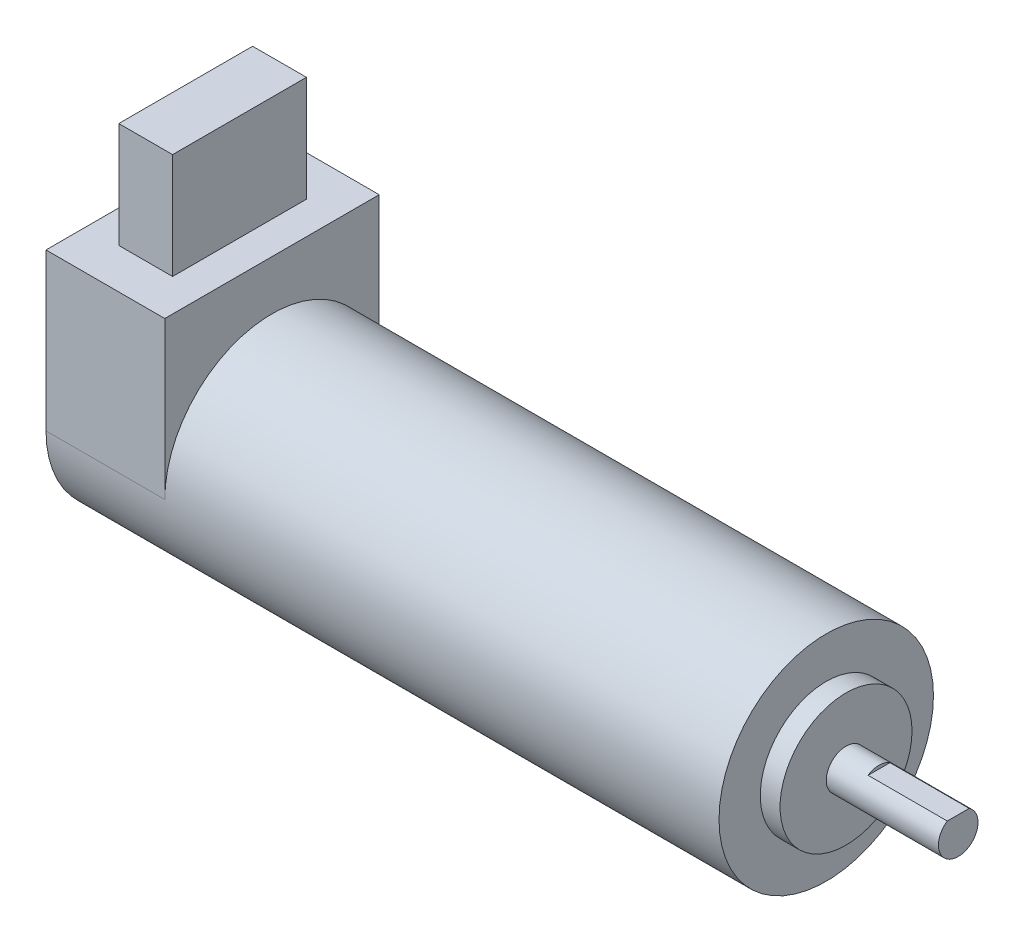
ISO-10303-21;
HEADER;
FILE_DESCRIPTION(('STEP AP214'),'2;1');
FILE_NAME('part.step','',(''),(''),'','','');
FILE_SCHEMA(('AUTOMOTIVE_DESIGN { 1 0 10303 214 1 1 1 1 }'));
ENDSEC;
DATA;
#1=APPLICATION_CONTEXT('core data for automotive mechanical design processes');
#2=APPLICATION_PROTOCOL_DEFINITION('international standard','automotive_design',2000,#1);
#3=PRODUCT_CONTEXT('',#1,'mechanical');
#4=PRODUCT('Part','Part','',(#3));
#5=PRODUCT_RELATED_PRODUCT_CATEGORY('part','',(#4));
#6=PRODUCT_DEFINITION_FORMATION('','',#4);
#7=PRODUCT_DEFINITION_CONTEXT('part definition',#1,'design');
#8=PRODUCT_DEFINITION('design','',#6,#7);
#9=PRODUCT_DEFINITION_SHAPE('','',#8);
#10=(LENGTH_UNIT() NAMED_UNIT(*) SI_UNIT(.MILLI.,.METRE.));
#11=(NAMED_UNIT(*) PLANE_ANGLE_UNIT() SI_UNIT($,.RADIAN.));
#12=(NAMED_UNIT(*) SI_UNIT($,.STERADIAN.) SOLID_ANGLE_UNIT());
#13=UNCERTAINTY_MEASURE_WITH_UNIT(LENGTH_MEASURE(1.E-05),#10,'distance_accuracy_value','');
#14=(GEOMETRIC_REPRESENTATION_CONTEXT(3) GLOBAL_UNCERTAINTY_ASSIGNED_CONTEXT((#13)) GLOBAL_UNIT_ASSIGNED_CONTEXT((#10,
#11,#12)) REPRESENTATION_CONTEXT('',''));
#15=CARTESIAN_POINT('',(0.,0.,0.));
#16=DIRECTION('',(0.,0.,1.));
#17=DIRECTION('',(1.,0.,0.));
#18=AXIS2_PLACEMENT_3D('',#15,#16,#17);
#19=CARTESIAN_POINT('',(84.,0.,0.));
#20=DIRECTION('',(-1.,0.,0.));
#21=DIRECTION('',(0.,0.,1.));
#22=AXIS2_PLACEMENT_3D('',#19,#20,#21);
#23=CYLINDRICAL_SURFACE('',#22,16.25);
#24=CARTESIAN_POINT('',(84.,0.,0.));
#25=DIRECTION('',(1.,0.,0.));
#26=DIRECTION('',(0.,0.,-1.));
#27=AXIS2_PLACEMENT_3D('',#24,#25,#26);
#28=CIRCLE('',#27,16.25);
#29=CARTESIAN_POINT('',(84.,0.,-16.25));
#30=VERTEX_POINT('',#29);
#31=EDGE_CURVE('E186',#30,#30,#28,.T.);
#32=ORIENTED_EDGE('',*,*,#31,.F.);
#33=EDGE_LOOP('',(#32));
#34=FACE_BOUND('',#33,.T.);
#35=CARTESIAN_POINT('',(0.,0.,0.));
#36=DIRECTION('',(1.,0.,0.));
#37=DIRECTION('',(0.,0.,-1.));
#38=AXIS2_PLACEMENT_3D('',#35,#36,#37);
#39=CIRCLE('',#38,16.25);
#40=CARTESIAN_POINT('',(0.,0.,-16.25));
#41=VERTEX_POINT('',#40);
#42=CARTESIAN_POINT('',(0.,0.,16.25));
#43=VERTEX_POINT('',#42);
#44=EDGE_CURVE('E38',#41,#43,#39,.T.);
#45=ORIENTED_EDGE('',*,*,#44,.T.);
#46=DIRECTION('',(1.,0.,0.));
#47=VECTOR('',#46,1.);
#48=CARTESIAN_POINT('',(-18.,0.,16.25));
#49=LINE('',#48,#47);
#50=CARTESIAN_POINT('',(-18.,0.,16.25));
#51=VERTEX_POINT('',#50);
#52=EDGE_CURVE('E165',#51,#43,#49,.T.);
#53=ORIENTED_EDGE('',*,*,#52,.F.);
#54=CARTESIAN_POINT('',(-18.,0.,0.));
#55=DIRECTION('',(-1.,0.,0.));
#56=DIRECTION('',(0.,0.,1.));
#57=AXIS2_PLACEMENT_3D('',#54,#55,#56);
#58=CIRCLE('',#57,16.25);
#59=CARTESIAN_POINT('',(-18.,0.,-16.25));
#60=VERTEX_POINT('',#59);
#61=EDGE_CURVE('E142',#60,#51,#58,.T.);
#62=ORIENTED_EDGE('',*,*,#61,.F.);
#63=DIRECTION('',(1.,0.,0.));
#64=VECTOR('',#63,1.);
#65=CARTESIAN_POINT('',(-18.,0.,-16.25));
#66=LINE('',#65,#64);
#67=EDGE_CURVE('E153',#60,#41,#66,.T.);
#68=ORIENTED_EDGE('',*,*,#67,.T.);
#69=EDGE_LOOP('',(#45,#53,#62,#68));
#70=FACE_BOUND('',#69,.T.);
#71=ADVANCED_FACE('F35',(#34,#70),#23,.T.);
#72=CARTESIAN_POINT('',(84.,0.,0.));
#73=DIRECTION('',(1.,0.,0.));
#74=DIRECTION('',(0.,0.,-1.));
#75=AXIS2_PLACEMENT_3D('',#72,#73,#74);
#76=PLANE('',#75);
#77=CARTESIAN_POINT('',(84.,0.,0.));
#78=DIRECTION('',(1.,0.,0.));
#79=DIRECTION('',(0.,0.,-1.));
#80=AXIS2_PLACEMENT_3D('',#77,#78,#79);
#81=CIRCLE('',#80,10.);
#82=CARTESIAN_POINT('',(84.,0.,-10.));
#83=VERTEX_POINT('',#82);
#84=EDGE_CURVE('E43',#83,#83,#81,.T.);
#85=ORIENTED_EDGE('',*,*,#84,.F.);
#86=EDGE_LOOP('',(#85));
#87=FACE_BOUND('',#86,.T.);
#88=ORIENTED_EDGE('',*,*,#31,.T.);
#89=EDGE_LOOP('',(#88));
#90=FACE_BOUND('',#89,.T.);
#91=ADVANCED_FACE('F221',(#87,#90),#76,.T.);
#92=CARTESIAN_POINT('',(87.,0.,0.));
#93=DIRECTION('',(-1.,0.,0.));
#94=DIRECTION('',(0.,0.,1.));
#95=AXIS2_PLACEMENT_3D('',#92,#93,#94);
#96=CYLINDRICAL_SURFACE('',#95,10.);
#97=CARTESIAN_POINT('',(87.,0.,0.));
#98=DIRECTION('',(1.,0.,0.));
#99=DIRECTION('',(0.,0.,-1.));
#100=AXIS2_PLACEMENT_3D('',#97,#98,#99);
#101=CIRCLE('',#100,10.);
#102=CARTESIAN_POINT('',(87.,0.,-10.));
#103=VERTEX_POINT('',#102);
#104=EDGE_CURVE('E181',#103,#103,#101,.T.);
#105=ORIENTED_EDGE('',*,*,#104,.F.);
#106=EDGE_LOOP('',(#105));
#107=FACE_BOUND('',#106,.T.);
#108=ORIENTED_EDGE('',*,*,#84,.T.);
#109=EDGE_LOOP('',(#108));
#110=FACE_BOUND('',#109,.T.);
#111=ADVANCED_FACE('F226',(#107,#110),#96,.T.);
#112=CARTESIAN_POINT('',(87.,0.,0.));
#113=DIRECTION('',(1.,0.,0.));
#114=DIRECTION('',(0.,0.,-1.));
#115=AXIS2_PLACEMENT_3D('',#112,#113,#114);
#116=PLANE('',#115);
#117=CARTESIAN_POINT('',(87.,0.,0.));
#118=DIRECTION('',(1.,0.,0.));
#119=DIRECTION('',(0.,0.,-1.));
#120=AXIS2_PLACEMENT_3D('',#117,#118,#119);
#121=CIRCLE('',#120,3.);
#122=CARTESIAN_POINT('',(87.,0.,-3.));
#123=VERTEX_POINT('',#122);
#124=EDGE_CURVE('E11',#123,#123,#121,.T.);
#125=ORIENTED_EDGE('',*,*,#124,.F.);
#126=EDGE_LOOP('',(#125));
#127=FACE_BOUND('',#126,.T.);
#128=ORIENTED_EDGE('',*,*,#104,.T.);
#129=EDGE_LOOP('',(#128));
#130=FACE_BOUND('',#129,.T.);
#131=ADVANCED_FACE('F231',(#127,#130),#116,.T.);
#132=CARTESIAN_POINT('',(104.,0.,0.));
#133=DIRECTION('',(-1.,0.,0.));
#134=DIRECTION('',(0.,0.,1.));
#135=AXIS2_PLACEMENT_3D('',#132,#133,#134);
#136=CYLINDRICAL_SURFACE('',#135,3.);
#137=CARTESIAN_POINT('',(104.,0.,0.));
#138=DIRECTION('',(1.,0.,0.));
#139=DIRECTION('',(0.,0.,-1.));
#140=AXIS2_PLACEMENT_3D('',#137,#138,#139);
#141=CIRCLE('',#140,3.);
#142=CARTESIAN_POINT('',(104.,2.5,1.6583123951777));
#143=VERTEX_POINT('',#142);
#144=CARTESIAN_POINT('',(104.,2.5,-1.6583123951777));
#145=VERTEX_POINT('',#144);
#146=EDGE_CURVE('E178',#143,#145,#141,.T.);
#147=ORIENTED_EDGE('',*,*,#146,.F.);
#148=DIRECTION('',(1.,0.,0.));
#149=VECTOR('',#148,1.);
#150=CARTESIAN_POINT('',(92.,2.5,1.6583123951777));
#151=LINE('',#150,#149);
#152=CARTESIAN_POINT('',(92.,2.5,1.6583123951777));
#153=VERTEX_POINT('',#152);
#154=EDGE_CURVE('E173',#153,#143,#151,.T.);
#155=ORIENTED_EDGE('',*,*,#154,.F.);
#156=CARTESIAN_POINT('',(92.,0.,0.));
#157=DIRECTION('',(1.,0.,0.));
#158=DIRECTION('',(0.,0.,-1.));
#159=AXIS2_PLACEMENT_3D('',#156,#157,#158);
#160=CIRCLE('',#159,3.);
#161=CARTESIAN_POINT('',(92.,2.5,-1.6583123951777));
#162=VERTEX_POINT('',#161);
#163=EDGE_CURVE('E168',#162,#153,#160,.T.);
#164=ORIENTED_EDGE('',*,*,#163,.F.);
#165=DIRECTION('',(1.,0.,0.));
#166=VECTOR('',#165,1.);
#167=CARTESIAN_POINT('',(92.,2.5,-1.6583123951777));
#168=LINE('',#167,#166);
#169=EDGE_CURVE('E175',#162,#145,#168,.T.);
#170=ORIENTED_EDGE('',*,*,#169,.T.);
#171=EDGE_LOOP('',(#147,#155,#164,#170));
#172=FACE_BOUND('',#171,.T.);
#173=ORIENTED_EDGE('',*,*,#124,.T.);
#174=EDGE_LOOP('',(#173));
#175=FACE_BOUND('',#174,.T.);
#176=ADVANCED_FACE('F238',(#172,#175),#136,.T.);
#177=CARTESIAN_POINT('',(104.,0.,0.));
#178=DIRECTION('',(1.,0.,0.));
#179=DIRECTION('',(0.,0.,-1.));
#180=AXIS2_PLACEMENT_3D('',#177,#178,#179);
#181=PLANE('',#180);
#182=DIRECTION('',(0.,0.,-1.));
#183=VECTOR('',#182,1.);
#184=CARTESIAN_POINT('',(104.,2.5,0.));
#185=LINE('',#184,#183);
#186=EDGE_CURVE('E167',#143,#145,#185,.T.);
#187=ORIENTED_EDGE('',*,*,#186,.F.);
#188=ORIENTED_EDGE('',*,*,#146,.T.);
#189=EDGE_LOOP('',(#187,#188));
#190=FACE_BOUND('',#189,.T.);
#191=ADVANCED_FACE('F242',(#190),#181,.T.);
#192=CARTESIAN_POINT('',(92.,2.5,0.));
#193=DIRECTION('',(0.,-1.,0.));
#194=DIRECTION('',(0.,0.,-1.));
#195=AXIS2_PLACEMENT_3D('',#192,#193,#194);
#196=PLANE('',#195);
#197=ORIENTED_EDGE('',*,*,#186,.T.);
#198=ORIENTED_EDGE('',*,*,#169,.F.);
#199=DIRECTION('',(0.,0.,-1.));
#200=VECTOR('',#199,1.);
#201=CARTESIAN_POINT('',(92.,2.5,0.));
#202=LINE('',#201,#200);
#203=EDGE_CURVE('E170',#153,#162,#202,.T.);
#204=ORIENTED_EDGE('',*,*,#203,.F.);
#205=ORIENTED_EDGE('',*,*,#154,.T.);
#206=EDGE_LOOP('',(#197,#198,#204,#205));
#207=FACE_BOUND('',#206,.T.);
#208=ADVANCED_FACE('F246',(#207),#196,.F.);
#209=CARTESIAN_POINT('',(92.,0.,0.));
#210=DIRECTION('',(1.,0.,0.));
#211=DIRECTION('',(0.,0.,-1.));
#212=AXIS2_PLACEMENT_3D('',#209,#210,#211);
#213=PLANE('',#212);
#214=ORIENTED_EDGE('',*,*,#163,.T.);
#215=ORIENTED_EDGE('',*,*,#203,.T.);
#216=EDGE_LOOP('',(#214,#215));
#217=FACE_BOUND('',#216,.T.);
#218=ADVANCED_FACE('F250',(#217),#213,.T.);
#219=CARTESIAN_POINT('',(-18.,0.,16.25));
#220=DIRECTION('',(0.,0.,1.));
#221=DIRECTION('',(1.,0.,0.));
#222=AXIS2_PLACEMENT_3D('',#219,#220,#221);
#223=PLANE('',#222);
#224=DIRECTION('',(0.,-1.,0.));
#225=VECTOR('',#224,1.);
#226=CARTESIAN_POINT('',(0.,0.,16.25));
#227=LINE('',#226,#225);
#228=CARTESIAN_POINT('',(0.,23.75,16.25));
#229=VERTEX_POINT('',#228);
#230=EDGE_CURVE('E133',#229,#43,#227,.T.);
#231=ORIENTED_EDGE('',*,*,#230,.F.);
#232=DIRECTION('',(1.,0.,0.));
#233=VECTOR('',#232,1.);
#234=CARTESIAN_POINT('',(-18.,23.75,16.25));
#235=LINE('',#234,#233);
#236=CARTESIAN_POINT('',(-18.,23.75,16.25));
#237=VERTEX_POINT('',#236);
#238=EDGE_CURVE('E163',#237,#229,#235,.T.);
#239=ORIENTED_EDGE('',*,*,#238,.F.);
#240=DIRECTION('',(0.,-1.,0.));
#241=VECTOR('',#240,1.);
#242=CARTESIAN_POINT('',(-18.,0.,16.25));
#243=LINE('',#242,#241);
#244=EDGE_CURVE('E144',#237,#51,#243,.T.);
#245=ORIENTED_EDGE('',*,*,#244,.T.);
#246=ORIENTED_EDGE('',*,*,#52,.T.);
#247=EDGE_LOOP('',(#231,#239,#245,#246));
#248=FACE_BOUND('',#247,.T.);
#249=ADVANCED_FACE('F200',(#248),#223,.T.);
#250=CARTESIAN_POINT('',(-18.,23.75,0.));
#251=DIRECTION('',(0.,1.,0.));
#252=DIRECTION('',(0.,0.,1.));
#253=AXIS2_PLACEMENT_3D('',#250,#251,#252);
#254=PLANE('',#253);
#255=DIRECTION('',(0.,0.,-1.));
#256=VECTOR('',#255,1.);
#257=CARTESIAN_POINT('',(-4.92258510529074,23.75,10.1440417077294));
#258=LINE('',#257,#256);
#259=CARTESIAN_POINT('',(-4.92258510529074,23.75,10.1440417077294));
#260=VERTEX_POINT('',#259);
#261=CARTESIAN_POINT('',(-4.92258510529074,23.75,-10.1440417077294));
#262=VERTEX_POINT('',#261);
#263=EDGE_CURVE('E51',#260,#262,#258,.T.);
#264=ORIENTED_EDGE('',*,*,#263,.F.);
#265=DIRECTION('',(1.,0.,0.));
#266=VECTOR('',#265,1.);
#267=CARTESIAN_POINT('',(-13.0774148947093,23.75,10.1440417077294));
#268=LINE('',#267,#266);
#269=CARTESIAN_POINT('',(-13.0774148947093,23.75,10.1440417077294));
#270=VERTEX_POINT('',#269);
#271=EDGE_CURVE('E55',#270,#260,#268,.T.);
#272=ORIENTED_EDGE('',*,*,#271,.F.);
#273=DIRECTION('',(0.,0.,1.));
#274=VECTOR('',#273,1.);
#275=CARTESIAN_POINT('',(-13.0774148947093,23.75,10.1440417077294));
#276=LINE('',#275,#274);
#277=CARTESIAN_POINT('',(-13.0774148947093,23.75,-10.1440417077294));
#278=VERTEX_POINT('',#277);
#279=EDGE_CURVE('E337',#278,#270,#276,.T.);
#280=ORIENTED_EDGE('',*,*,#279,.F.);
#281=DIRECTION('',(-1.,0.,0.));
#282=VECTOR('',#281,1.);
#283=CARTESIAN_POINT('',(-13.0774148947093,23.75,-10.1440417077294));
#284=LINE('',#283,#282);
#285=EDGE_CURVE('E343',#262,#278,#284,.T.);
#286=ORIENTED_EDGE('',*,*,#285,.F.);
#287=EDGE_LOOP('',(#264,#272,#280,#286));
#288=FACE_BOUND('',#287,.T.);
#289=DIRECTION('',(0.,0.,1.));
#290=VECTOR('',#289,1.);
#291=CARTESIAN_POINT('',(0.,23.75,0.));
#292=LINE('',#291,#290);
#293=CARTESIAN_POINT('',(0.,23.75,-16.25));
#294=VERTEX_POINT('',#293);
#295=EDGE_CURVE('E136',#294,#229,#292,.T.);
#296=ORIENTED_EDGE('',*,*,#295,.F.);
#297=DIRECTION('',(1.,0.,0.));
#298=VECTOR('',#297,1.);
#299=CARTESIAN_POINT('',(-18.,23.75,-16.25));
#300=LINE('',#299,#298);
#301=CARTESIAN_POINT('',(-18.,23.75,-16.25));
#302=VERTEX_POINT('',#301);
#303=EDGE_CURVE('E161',#302,#294,#300,.T.);
#304=ORIENTED_EDGE('',*,*,#303,.F.);
#305=DIRECTION('',(0.,0.,1.));
#306=VECTOR('',#305,1.);
#307=CARTESIAN_POINT('',(-18.,23.75,0.));
#308=LINE('',#307,#306);
#309=EDGE_CURVE('E148',#302,#237,#308,.T.);
#310=ORIENTED_EDGE('',*,*,#309,.T.);
#311=ORIENTED_EDGE('',*,*,#238,.T.);
#312=EDGE_LOOP('',(#296,#304,#310,#311));
#313=FACE_BOUND('',#312,.T.);
#314=ADVANCED_FACE('F207',(#288,#313),#254,.T.);
#315=CARTESIAN_POINT('',(-18.,0.,-16.25));
#316=DIRECTION('',(0.,0.,-1.));
#317=DIRECTION('',(-1.,0.,0.));
#318=AXIS2_PLACEMENT_3D('',#315,#316,#317);
#319=PLANE('',#318);
#320=DIRECTION('',(0.,1.,0.));
#321=VECTOR('',#320,1.);
#322=CARTESIAN_POINT('',(0.,0.,-16.25));
#323=LINE('',#322,#321);
#324=EDGE_CURVE('E145',#41,#294,#323,.T.);
#325=ORIENTED_EDGE('',*,*,#324,.F.);
#326=ORIENTED_EDGE('',*,*,#67,.F.);
#327=DIRECTION('',(0.,1.,0.));
#328=VECTOR('',#327,1.);
#329=CARTESIAN_POINT('',(-18.,0.,-16.25));
#330=LINE('',#329,#328);
#331=EDGE_CURVE('E151',#60,#302,#330,.T.);
#332=ORIENTED_EDGE('',*,*,#331,.T.);
#333=ORIENTED_EDGE('',*,*,#303,.T.);
#334=EDGE_LOOP('',(#325,#326,#332,#333));
#335=FACE_BOUND('',#334,.T.);
#336=ADVANCED_FACE('F209',(#335),#319,.T.);
#337=CARTESIAN_POINT('',(-18.,0.,0.));
#338=DIRECTION('',(-1.,0.,0.));
#339=DIRECTION('',(0.,0.,1.));
#340=AXIS2_PLACEMENT_3D('',#337,#338,#339);
#341=PLANE('',#340);
#342=ORIENTED_EDGE('',*,*,#61,.T.);
#343=ORIENTED_EDGE('',*,*,#244,.F.);
#344=ORIENTED_EDGE('',*,*,#309,.F.);
#345=ORIENTED_EDGE('',*,*,#331,.F.);
#346=EDGE_LOOP('',(#342,#343,#344,#345));
#347=FACE_BOUND('',#346,.T.);
#348=ADVANCED_FACE('F204',(#347),#341,.T.);
#349=CARTESIAN_POINT('',(0.,0.,0.));
#350=DIRECTION('',(-1.,0.,0.));
#351=DIRECTION('',(0.,0.,1.));
#352=AXIS2_PLACEMENT_3D('',#349,#350,#351);
#353=PLANE('',#352);
#354=ORIENTED_EDGE('',*,*,#44,.F.);
#355=ORIENTED_EDGE('',*,*,#324,.T.);
#356=ORIENTED_EDGE('',*,*,#295,.T.);
#357=ORIENTED_EDGE('',*,*,#230,.T.);
#358=EDGE_LOOP('',(#354,#355,#356,#357));
#359=FACE_BOUND('',#358,.T.);
#360=ADVANCED_FACE('F196',(#359),#353,.F.);
#361=CARTESIAN_POINT('',(-4.92258510529074,39.75,10.1440417077294));
#362=DIRECTION('',(-1.,0.,0.));
#363=DIRECTION('',(0.,0.,1.));
#364=AXIS2_PLACEMENT_3D('',#361,#362,#363);
#365=PLANE('',#364);
#366=ORIENTED_EDGE('',*,*,#263,.T.);
#367=DIRECTION('',(0.,-1.,0.));
#368=VECTOR('',#367,1.);
#369=CARTESIAN_POINT('',(-4.92258510529074,39.75,-10.1440417077294));
#370=LINE('',#369,#368);
#371=CARTESIAN_POINT('',(-4.92258510529074,39.75,-10.1440417077294));
#372=VERTEX_POINT('',#371);
#373=EDGE_CURVE('E116',#372,#262,#370,.T.);
#374=ORIENTED_EDGE('',*,*,#373,.F.);
#375=DIRECTION('',(0.,0.,-1.));
#376=VECTOR('',#375,1.);
#377=CARTESIAN_POINT('',(-4.92258510529074,39.75,10.1440417077294));
#378=LINE('',#377,#376);
#379=CARTESIAN_POINT('',(-4.92258510529074,39.75,10.1440417077294));
#380=VERTEX_POINT('',#379);
#381=EDGE_CURVE('E122',#380,#372,#378,.T.);
#382=ORIENTED_EDGE('',*,*,#381,.F.);
#383=DIRECTION('',(0.,-1.,0.));
#384=VECTOR('',#383,1.);
#385=CARTESIAN_POINT('',(-4.92258510529074,39.75,10.1440417077294));
#386=LINE('',#385,#384);
#387=EDGE_CURVE('E335',#380,#260,#386,.T.);
#388=ORIENTED_EDGE('',*,*,#387,.T.);
#389=EDGE_LOOP('',(#366,#374,#382,#388));
#390=FACE_BOUND('',#389,.T.);
#391=ADVANCED_FACE('F132',(#390),#365,.F.);
#392=CARTESIAN_POINT('',(-13.0774148947093,39.75,-10.1440417077294));
#393=DIRECTION('',(0.,0.,1.));
#394=DIRECTION('',(1.,0.,0.));
#395=AXIS2_PLACEMENT_3D('',#392,#393,#394);
#396=PLANE('',#395);
#397=ORIENTED_EDGE('',*,*,#285,.T.);
#398=DIRECTION('',(0.,-1.,0.));
#399=VECTOR('',#398,1.);
#400=CARTESIAN_POINT('',(-13.0774148947093,39.75,-10.1440417077294));
#401=LINE('',#400,#399);
#402=CARTESIAN_POINT('',(-13.0774148947093,39.75,-10.1440417077294));
#403=VERTEX_POINT('',#402);
#404=EDGE_CURVE('E118',#403,#278,#401,.T.);
#405=ORIENTED_EDGE('',*,*,#404,.F.);
#406=DIRECTION('',(-1.,0.,0.));
#407=VECTOR('',#406,1.);
#408=CARTESIAN_POINT('',(-13.0774148947093,39.75,-10.1440417077294));
#409=LINE('',#408,#407);
#410=EDGE_CURVE('E111',#372,#403,#409,.T.);
#411=ORIENTED_EDGE('',*,*,#410,.F.);
#412=ORIENTED_EDGE('',*,*,#373,.T.);
#413=EDGE_LOOP('',(#397,#405,#411,#412));
#414=FACE_BOUND('',#413,.T.);
#415=ADVANCED_FACE('F114',(#414),#396,.F.);
#416=CARTESIAN_POINT('',(-13.0774148947093,39.75,10.1440417077294));
#417=DIRECTION('',(1.,0.,0.));
#418=DIRECTION('',(0.,0.,-1.));
#419=AXIS2_PLACEMENT_3D('',#416,#417,#418);
#420=PLANE('',#419);
#421=ORIENTED_EDGE('',*,*,#279,.T.);
#422=DIRECTION('',(0.,-1.,0.));
#423=VECTOR('',#422,1.);
#424=CARTESIAN_POINT('',(-13.0774148947093,39.75,10.1440417077294));
#425=LINE('',#424,#423);
#426=CARTESIAN_POINT('',(-13.0774148947093,39.75,10.1440417077294));
#427=VERTEX_POINT('',#426);
#428=EDGE_CURVE('E138',#427,#270,#425,.T.);
#429=ORIENTED_EDGE('',*,*,#428,.F.);
#430=DIRECTION('',(0.,0.,1.));
#431=VECTOR('',#430,1.);
#432=CARTESIAN_POINT('',(-13.0774148947093,39.75,10.1440417077294));
#433=LINE('',#432,#431);
#434=EDGE_CURVE('E121',#403,#427,#433,.T.);
#435=ORIENTED_EDGE('',*,*,#434,.F.);
#436=ORIENTED_EDGE('',*,*,#404,.T.);
#437=EDGE_LOOP('',(#421,#429,#435,#436));
#438=FACE_BOUND('',#437,.T.);
#439=ADVANCED_FACE('F286',(#438),#420,.F.);
#440=CARTESIAN_POINT('',(-13.0774148947093,39.75,10.1440417077294));
#441=DIRECTION('',(0.,0.,-1.));
#442=DIRECTION('',(-1.,0.,0.));
#443=AXIS2_PLACEMENT_3D('',#440,#441,#442);
#444=PLANE('',#443);
#445=ORIENTED_EDGE('',*,*,#271,.T.);
#446=ORIENTED_EDGE('',*,*,#387,.F.);
#447=DIRECTION('',(1.,0.,0.));
#448=VECTOR('',#447,1.);
#449=CARTESIAN_POINT('',(-13.0774148947093,39.75,10.1440417077294));
#450=LINE('',#449,#448);
#451=EDGE_CURVE('E127',#427,#380,#450,.T.);
#452=ORIENTED_EDGE('',*,*,#451,.F.);
#453=ORIENTED_EDGE('',*,*,#428,.T.);
#454=EDGE_LOOP('',(#445,#446,#452,#453));
#455=FACE_BOUND('',#454,.T.);
#456=ADVANCED_FACE('F295',(#455),#444,.F.);
#457=CARTESIAN_POINT('',(0.,39.75,0.));
#458=DIRECTION('',(0.,-1.,0.));
#459=DIRECTION('',(0.,0.,-1.));
#460=AXIS2_PLACEMENT_3D('',#457,#458,#459);
#461=PLANE('',#460);
#462=ORIENTED_EDGE('',*,*,#381,.T.);
#463=ORIENTED_EDGE('',*,*,#410,.T.);
#464=ORIENTED_EDGE('',*,*,#434,.T.);
#465=ORIENTED_EDGE('',*,*,#451,.T.);
#466=EDGE_LOOP('',(#462,#463,#464,#465));
#467=FACE_BOUND('',#466,.T.);
#468=ADVANCED_FACE('F125',(#467),#461,.F.);
#469=CLOSED_SHELL('',(#71,#91,#111,#131,#176,#191,#208,#218,#249,#314,#336,#348,#360,#391,#415,
#439,#456,#468));
#470=MANIFOLD_SOLID_BREP('B2',#469);
#471=ADVANCED_BREP_SHAPE_REPRESENTATION('',(#18,#470),#14);
#472=SHAPE_DEFINITION_REPRESENTATION(#9,#471);
ENDSEC;
END-ISO-10303-21;
